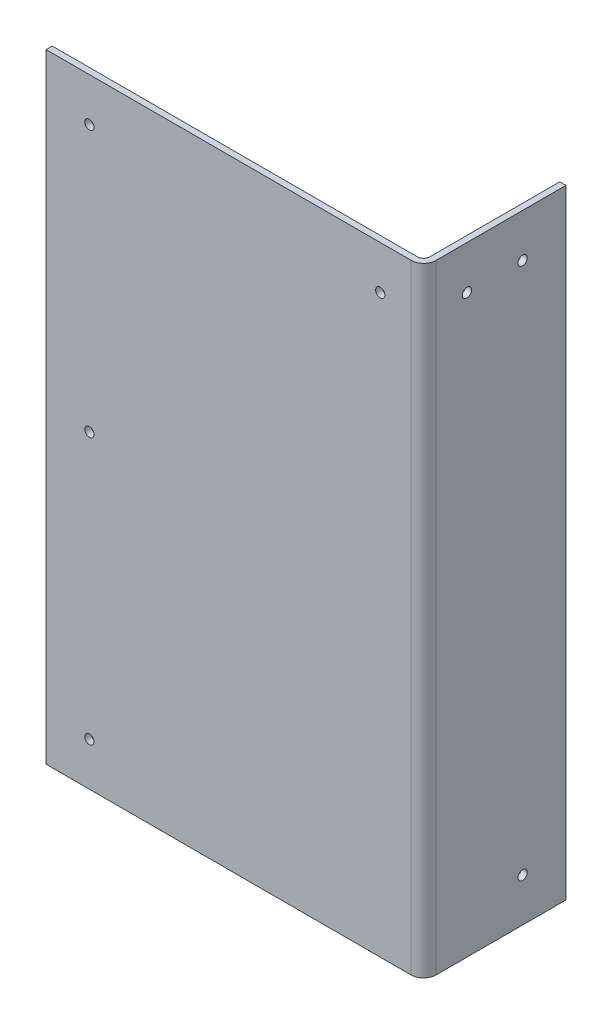
ISO-10303-21;
HEADER;
FILE_DESCRIPTION(('STEP AP214'),'2;1');
FILE_NAME('part.step','',(''),(''),'','','');
FILE_SCHEMA(('AUTOMOTIVE_DESIGN { 1 0 10303 214 1 1 1 1 }'));
ENDSEC;
DATA;
#1=APPLICATION_CONTEXT('core data for automotive mechanical design processes');
#2=APPLICATION_PROTOCOL_DEFINITION('international standard','automotive_design',2000,#1);
#3=PRODUCT_CONTEXT('',#1,'mechanical');
#4=PRODUCT('Part','Part','',(#3));
#5=PRODUCT_RELATED_PRODUCT_CATEGORY('part','',(#4));
#6=PRODUCT_DEFINITION_FORMATION('','',#4);
#7=PRODUCT_DEFINITION_CONTEXT('part definition',#1,'design');
#8=PRODUCT_DEFINITION('design','',#6,#7);
#9=PRODUCT_DEFINITION_SHAPE('','',#8);
#10=(LENGTH_UNIT() NAMED_UNIT(*) SI_UNIT(.MILLI.,.METRE.));
#11=(NAMED_UNIT(*) PLANE_ANGLE_UNIT() SI_UNIT($,.RADIAN.));
#12=(NAMED_UNIT(*) SI_UNIT($,.STERADIAN.) SOLID_ANGLE_UNIT());
#13=UNCERTAINTY_MEASURE_WITH_UNIT(LENGTH_MEASURE(1.E-05),#10,'distance_accuracy_value','');
#14=(GEOMETRIC_REPRESENTATION_CONTEXT(3) GLOBAL_UNCERTAINTY_ASSIGNED_CONTEXT((#13)) GLOBAL_UNIT_ASSIGNED_CONTEXT((#10,
#11,#12)) REPRESENTATION_CONTEXT('',''));
#15=CARTESIAN_POINT('',(0.,0.,0.));
#16=DIRECTION('',(0.,0.,1.));
#17=DIRECTION('',(1.,0.,0.));
#18=AXIS2_PLACEMENT_3D('',#15,#16,#17);
#19=CARTESIAN_POINT('',(387.35,-317.5,-139.7));
#20=DIRECTION('',(-1.,0.,0.));
#21=DIRECTION('',(0.,0.,1.));
#22=AXIS2_PLACEMENT_3D('',#19,#20,#21);
#23=PLANE('',#22);
#24=CARTESIAN_POINT('',(387.35,-273.05,-95.25));
#25=DIRECTION('',(-1.,0.,0.));
#26=DIRECTION('',(0.,0.,1.));
#27=AXIS2_PLACEMENT_3D('',#24,#25,#26);
#28=CIRCLE('',#27,4.7625);
#29=CARTESIAN_POINT('',(387.35,-273.05,-90.4875));
#30=VERTEX_POINT('',#29);
#31=EDGE_CURVE('E136',#30,#30,#28,.T.);
#32=ORIENTED_EDGE('',*,*,#31,.T.);
#33=EDGE_LOOP('',(#32));
#34=FACE_BOUND('',#33,.T.);
#35=CARTESIAN_POINT('',(387.35,273.05,-95.25));
#36=DIRECTION('',(-1.,0.,0.));
#37=DIRECTION('',(0.,0.,1.));
#38=AXIS2_PLACEMENT_3D('',#35,#36,#37);
#39=CIRCLE('',#38,4.7625);
#40=CARTESIAN_POINT('',(387.35,273.05,-90.4875));
#41=VERTEX_POINT('',#40);
#42=EDGE_CURVE('E138',#41,#41,#39,.T.);
#43=ORIENTED_EDGE('',*,*,#42,.T.);
#44=EDGE_LOOP('',(#43));
#45=FACE_BOUND('',#44,.T.);
#46=CARTESIAN_POINT('',(387.35,273.05,-38.1));
#47=DIRECTION('',(-1.,0.,0.));
#48=DIRECTION('',(0.,0.,1.));
#49=AXIS2_PLACEMENT_3D('',#46,#47,#48);
#50=CIRCLE('',#49,4.7625);
#51=CARTESIAN_POINT('',(387.35,273.05,-33.3375));
#52=VERTEX_POINT('',#51);
#53=EDGE_CURVE('E20',#52,#52,#50,.T.);
#54=ORIENTED_EDGE('',*,*,#53,.T.);
#55=EDGE_LOOP('',(#54));
#56=FACE_BOUND('',#55,.T.);
#57=DIRECTION('',(0.,0.,-1.));
#58=VECTOR('',#57,1.);
#59=CARTESIAN_POINT('',(387.35,317.5,-68.2625));
#60=LINE('',#59,#58);
#61=CARTESIAN_POINT('',(387.35,317.5,-139.7));
#62=VERTEX_POINT('',#61);
#63=CARTESIAN_POINT('',(387.35,317.5,-6.35));
#64=VERTEX_POINT('',#63);
#65=EDGE_CURVE('E213',#62,#64,#60,.F.);
#66=ORIENTED_EDGE('',*,*,#65,.T.);
#67=DIRECTION('',(0.,1.,0.));
#68=VECTOR('',#67,1.);
#69=CARTESIAN_POINT('',(387.35,-317.5,-6.35));
#70=LINE('',#69,#68);
#71=CARTESIAN_POINT('',(387.35,-317.5,-6.35));
#72=VERTEX_POINT('',#71);
#73=EDGE_CURVE('E99',#72,#64,#70,.T.);
#74=ORIENTED_EDGE('',*,*,#73,.F.);
#75=DIRECTION('',(0.,0.,-1.));
#76=VECTOR('',#75,1.);
#77=CARTESIAN_POINT('',(387.35,-317.5,-68.2625));
#78=LINE('',#77,#76);
#79=CARTESIAN_POINT('',(387.35,-317.5,-139.7));
#80=VERTEX_POINT('',#79);
#81=EDGE_CURVE('E206',#80,#72,#78,.F.);
#82=ORIENTED_EDGE('',*,*,#81,.F.);
#83=DIRECTION('',(0.,1.,0.));
#84=VECTOR('',#83,1.);
#85=CARTESIAN_POINT('',(387.35,0.,-139.7));
#86=LINE('',#85,#84);
#87=EDGE_CURVE('E143',#80,#62,#86,.T.);
#88=ORIENTED_EDGE('',*,*,#87,.T.);
#89=EDGE_LOOP('',(#66,#74,#82,#88));
#90=FACE_BOUND('',#89,.T.);
#91=ADVANCED_FACE('F17',(#34,#45,#56,#90),#23,.F.);
#92=CARTESIAN_POINT('',(384.175,0.,-139.7));
#93=DIRECTION('',(0.,0.,1.));
#94=DIRECTION('',(1.,0.,0.));
#95=AXIS2_PLACEMENT_3D('',#92,#93,#94);
#96=PLANE('',#95);
#97=ORIENTED_EDGE('',*,*,#87,.F.);
#98=DIRECTION('',(1.,0.,0.));
#99=VECTOR('',#98,1.);
#100=CARTESIAN_POINT('',(384.175,-317.5,-139.7));
#101=LINE('',#100,#99);
#102=CARTESIAN_POINT('',(381.,-317.5,-139.7));
#103=VERTEX_POINT('',#102);
#104=EDGE_CURVE('E209',#103,#80,#101,.T.);
#105=ORIENTED_EDGE('',*,*,#104,.F.);
#106=DIRECTION('',(0.,1.,0.));
#107=VECTOR('',#106,1.);
#108=CARTESIAN_POINT('',(381.,-317.5,-139.7));
#109=LINE('',#108,#107);
#110=CARTESIAN_POINT('',(381.,317.5,-139.7));
#111=VERTEX_POINT('',#110);
#112=EDGE_CURVE('E98',#111,#103,#109,.F.);
#113=ORIENTED_EDGE('',*,*,#112,.F.);
#114=DIRECTION('',(1.,0.,0.));
#115=VECTOR('',#114,1.);
#116=CARTESIAN_POINT('',(384.175,317.5,-139.7));
#117=LINE('',#116,#115);
#118=EDGE_CURVE('E94',#111,#62,#117,.T.);
#119=ORIENTED_EDGE('',*,*,#118,.T.);
#120=EDGE_LOOP('',(#97,#105,#113,#119));
#121=FACE_BOUND('',#120,.T.);
#122=ADVANCED_FACE('F224',(#121),#96,.F.);
#123=CARTESIAN_POINT('',(387.35,273.05,-38.1));
#124=DIRECTION('',(-1.,0.,0.));
#125=DIRECTION('',(0.,0.,1.));
#126=AXIS2_PLACEMENT_3D('',#123,#124,#125);
#127=CYLINDRICAL_SURFACE('',#126,4.7625);
#128=ORIENTED_EDGE('',*,*,#53,.F.);
#129=EDGE_LOOP('',(#128));
#130=FACE_BOUND('',#129,.T.);
#131=CARTESIAN_POINT('',(381.,273.05,-38.1));
#132=DIRECTION('',(-1.,0.,0.));
#133=DIRECTION('',(0.,0.,1.));
#134=AXIS2_PLACEMENT_3D('',#131,#132,#133);
#135=CIRCLE('',#134,4.7625);
#136=CARTESIAN_POINT('',(381.,273.05,-33.3375));
#137=VERTEX_POINT('',#136);
#138=EDGE_CURVE('E133',#137,#137,#135,.F.);
#139=ORIENTED_EDGE('',*,*,#138,.F.);
#140=EDGE_LOOP('',(#139));
#141=FACE_BOUND('',#140,.T.);
#142=ADVANCED_FACE('F371',(#130,#141),#127,.F.);
#143=CARTESIAN_POINT('',(387.35,273.05,-95.25));
#144=DIRECTION('',(-1.,0.,0.));
#145=DIRECTION('',(0.,0.,1.));
#146=AXIS2_PLACEMENT_3D('',#143,#144,#145);
#147=CYLINDRICAL_SURFACE('',#146,4.7625);
#148=ORIENTED_EDGE('',*,*,#42,.F.);
#149=EDGE_LOOP('',(#148));
#150=FACE_BOUND('',#149,.T.);
#151=CARTESIAN_POINT('',(381.,273.05,-95.25));
#152=DIRECTION('',(-1.,0.,0.));
#153=DIRECTION('',(0.,0.,1.));
#154=AXIS2_PLACEMENT_3D('',#151,#152,#153);
#155=CIRCLE('',#154,4.7625);
#156=CARTESIAN_POINT('',(381.,273.05,-90.4875));
#157=VERTEX_POINT('',#156);
#158=EDGE_CURVE('E130',#157,#157,#155,.F.);
#159=ORIENTED_EDGE('',*,*,#158,.F.);
#160=EDGE_LOOP('',(#159));
#161=FACE_BOUND('',#160,.T.);
#162=ADVANCED_FACE('F362',(#150,#161),#147,.F.);
#163=CARTESIAN_POINT('',(387.35,-273.05,-95.25));
#164=DIRECTION('',(-1.,0.,0.));
#165=DIRECTION('',(0.,0.,1.));
#166=AXIS2_PLACEMENT_3D('',#163,#164,#165);
#167=CYLINDRICAL_SURFACE('',#166,4.7625);
#168=ORIENTED_EDGE('',*,*,#31,.F.);
#169=EDGE_LOOP('',(#168));
#170=FACE_BOUND('',#169,.T.);
#171=CARTESIAN_POINT('',(381.,-273.05,-95.25));
#172=DIRECTION('',(-1.,0.,0.));
#173=DIRECTION('',(0.,0.,1.));
#174=AXIS2_PLACEMENT_3D('',#171,#172,#173);
#175=CIRCLE('',#174,4.7625);
#176=CARTESIAN_POINT('',(381.,-273.05,-90.4875));
#177=VERTEX_POINT('',#176);
#178=EDGE_CURVE('E127',#177,#177,#175,.F.);
#179=ORIENTED_EDGE('',*,*,#178,.F.);
#180=EDGE_LOOP('',(#179));
#181=FACE_BOUND('',#180,.T.);
#182=ADVANCED_FACE('F354',(#170,#181),#167,.F.);
#183=CARTESIAN_POINT('',(374.65,-317.5,-6.35));
#184=DIRECTION('',(0.,1.,0.));
#185=DIRECTION('',(0.,0.,1.));
#186=AXIS2_PLACEMENT_3D('',#183,#184,#185);
#187=CYLINDRICAL_SURFACE('',#186,12.7);
#188=CARTESIAN_POINT('',(374.65,317.5,-6.35));
#189=DIRECTION('',(0.,1.,0.));
#190=DIRECTION('',(0.,0.,1.));
#191=AXIS2_PLACEMENT_3D('',#188,#189,#190);
#192=CIRCLE('',#191,12.7);
#193=CARTESIAN_POINT('',(374.65,317.5,6.35));
#194=VERTEX_POINT('',#193);
#195=EDGE_CURVE('E57',#194,#64,#192,.T.);
#196=ORIENTED_EDGE('',*,*,#195,.F.);
#197=DIRECTION('',(0.,1.,0.));
#198=VECTOR('',#197,1.);
#199=CARTESIAN_POINT('',(374.65,-317.5,6.35));
#200=LINE('',#199,#198);
#201=CARTESIAN_POINT('',(374.65,-317.5,6.35));
#202=VERTEX_POINT('',#201);
#203=EDGE_CURVE('E125',#194,#202,#200,.F.);
#204=ORIENTED_EDGE('',*,*,#203,.T.);
#205=CARTESIAN_POINT('',(374.65,-317.5,-6.35));
#206=DIRECTION('',(0.,1.,0.));
#207=DIRECTION('',(0.,0.,1.));
#208=AXIS2_PLACEMENT_3D('',#205,#206,#207);
#209=CIRCLE('',#208,12.7);
#210=EDGE_CURVE('E122',#202,#72,#209,.T.);
#211=ORIENTED_EDGE('',*,*,#210,.T.);
#212=ORIENTED_EDGE('',*,*,#73,.T.);
#213=EDGE_LOOP('',(#196,#204,#211,#212));
#214=FACE_BOUND('',#213,.T.);
#215=ADVANCED_FACE('F225',(#214),#187,.T.);
#216=CARTESIAN_POINT('',(381.,-317.5,-139.7));
#217=DIRECTION('',(-1.,0.,0.));
#218=DIRECTION('',(0.,0.,1.));
#219=AXIS2_PLACEMENT_3D('',#216,#217,#218);
#220=PLANE('',#219);
#221=ORIENTED_EDGE('',*,*,#178,.T.);
#222=EDGE_LOOP('',(#221));
#223=FACE_BOUND('',#222,.T.);
#224=ORIENTED_EDGE('',*,*,#158,.T.);
#225=EDGE_LOOP('',(#224));
#226=FACE_BOUND('',#225,.T.);
#227=ORIENTED_EDGE('',*,*,#138,.T.);
#228=EDGE_LOOP('',(#227));
#229=FACE_BOUND('',#228,.T.);
#230=ORIENTED_EDGE('',*,*,#112,.T.);
#231=DIRECTION('',(0.,0.,1.));
#232=VECTOR('',#231,1.);
#233=CARTESIAN_POINT('',(381.,-317.5,-139.7));
#234=LINE('',#233,#232);
#235=CARTESIAN_POINT('',(381.,-317.5,-6.35));
#236=VERTEX_POINT('',#235);
#237=EDGE_CURVE('E105',#103,#236,#234,.T.);
#238=ORIENTED_EDGE('',*,*,#237,.T.);
#239=DIRECTION('',(0.,1.,0.));
#240=VECTOR('',#239,1.);
#241=CARTESIAN_POINT('',(381.,-317.5,-6.35));
#242=LINE('',#241,#240);
#243=CARTESIAN_POINT('',(381.,317.5,-6.35));
#244=VERTEX_POINT('',#243);
#245=EDGE_CURVE('E102',#236,#244,#242,.T.);
#246=ORIENTED_EDGE('',*,*,#245,.T.);
#247=DIRECTION('',(0.,0.,1.));
#248=VECTOR('',#247,1.);
#249=CARTESIAN_POINT('',(381.,317.5,-139.7));
#250=LINE('',#249,#248);
#251=EDGE_CURVE('E85',#244,#111,#250,.F.);
#252=ORIENTED_EDGE('',*,*,#251,.T.);
#253=EDGE_LOOP('',(#230,#238,#246,#252));
#254=FACE_BOUND('',#253,.T.);
#255=ADVANCED_FACE('F103',(#223,#226,#229,#254),#220,.T.);
#256=CARTESIAN_POINT('',(381.,-317.5,6.35));
#257=DIRECTION('',(0.,0.,-1.));
#258=DIRECTION('',(-1.,0.,0.));
#259=AXIS2_PLACEMENT_3D('',#256,#257,#258);
#260=PLANE('',#259);
#261=CARTESIAN_POINT('',(342.9,273.05,6.35));
#262=DIRECTION('',(0.,0.,-1.));
#263=DIRECTION('',(-1.,0.,0.));
#264=AXIS2_PLACEMENT_3D('',#261,#262,#263);
#265=CIRCLE('',#264,4.7625);
#266=CARTESIAN_POINT('',(338.1375,273.05,6.35));
#267=VERTEX_POINT('',#266);
#268=EDGE_CURVE('E165',#267,#267,#265,.T.);
#269=ORIENTED_EDGE('',*,*,#268,.T.);
#270=EDGE_LOOP('',(#269));
#271=FACE_BOUND('',#270,.T.);
#272=CARTESIAN_POINT('',(44.45,-273.05,6.35));
#273=DIRECTION('',(0.,0.,-1.));
#274=DIRECTION('',(-1.,0.,0.));
#275=AXIS2_PLACEMENT_3D('',#272,#273,#274);
#276=CIRCLE('',#275,4.7625);
#277=CARTESIAN_POINT('',(39.6875,-273.05,6.35));
#278=VERTEX_POINT('',#277);
#279=EDGE_CURVE('E169',#278,#278,#276,.T.);
#280=ORIENTED_EDGE('',*,*,#279,.T.);
#281=EDGE_LOOP('',(#280));
#282=FACE_BOUND('',#281,.T.);
#283=CARTESIAN_POINT('',(44.45,0.,6.35));
#284=DIRECTION('',(0.,0.,-1.));
#285=DIRECTION('',(-1.,0.,0.));
#286=AXIS2_PLACEMENT_3D('',#283,#284,#285);
#287=CIRCLE('',#286,4.7625);
#288=CARTESIAN_POINT('',(39.6875,0.,6.35));
#289=VERTEX_POINT('',#288);
#290=EDGE_CURVE('E171',#289,#289,#287,.T.);
#291=ORIENTED_EDGE('',*,*,#290,.T.);
#292=EDGE_LOOP('',(#291));
#293=FACE_BOUND('',#292,.T.);
#294=CARTESIAN_POINT('',(44.45,273.05,6.35));
#295=DIRECTION('',(0.,0.,-1.));
#296=DIRECTION('',(-1.,0.,0.));
#297=AXIS2_PLACEMENT_3D('',#294,#295,#296);
#298=CIRCLE('',#297,4.7625);
#299=CARTESIAN_POINT('',(39.6875,273.05,6.35));
#300=VERTEX_POINT('',#299);
#301=EDGE_CURVE('E118',#300,#300,#298,.T.);
#302=ORIENTED_EDGE('',*,*,#301,.T.);
#303=EDGE_LOOP('',(#302));
#304=FACE_BOUND('',#303,.T.);
#305=DIRECTION('',(1.,0.,0.));
#306=VECTOR('',#305,1.);
#307=CARTESIAN_POINT('',(192.0875,317.5,6.35));
#308=LINE('',#307,#306);
#309=CARTESIAN_POINT('',(0.,317.5,6.35));
#310=VERTEX_POINT('',#309);
#311=EDGE_CURVE('E64',#194,#310,#308,.F.);
#312=ORIENTED_EDGE('',*,*,#311,.T.);
#313=DIRECTION('',(0.,1.,0.));
#314=VECTOR('',#313,1.);
#315=CARTESIAN_POINT('',(0.,0.,6.35));
#316=LINE('',#315,#314);
#317=CARTESIAN_POINT('',(0.,-317.5,6.35));
#318=VERTEX_POINT('',#317);
#319=EDGE_CURVE('E188',#318,#310,#316,.T.);
#320=ORIENTED_EDGE('',*,*,#319,.F.);
#321=DIRECTION('',(1.,0.,0.));
#322=VECTOR('',#321,1.);
#323=CARTESIAN_POINT('',(192.0875,-317.5,6.35));
#324=LINE('',#323,#322);
#325=EDGE_CURVE('E111',#202,#318,#324,.F.);
#326=ORIENTED_EDGE('',*,*,#325,.F.);
#327=ORIENTED_EDGE('',*,*,#203,.F.);
#328=EDGE_LOOP('',(#312,#320,#326,#327));
#329=FACE_BOUND('',#328,.T.);
#330=ADVANCED_FACE('F239',(#271,#282,#293,#304,#329),#260,.F.);
#331=CARTESIAN_POINT('',(0.,0.,3.175));
#332=DIRECTION('',(-1.,0.,0.));
#333=DIRECTION('',(0.,0.,1.));
#334=AXIS2_PLACEMENT_3D('',#331,#332,#333);
#335=PLANE('',#334);
#336=DIRECTION('',(0.,0.,-1.));
#337=VECTOR('',#336,1.);
#338=CARTESIAN_POINT('',(0.,317.5,3.175));
#339=LINE('',#338,#337);
#340=CARTESIAN_POINT('',(0.,317.5,0.));
#341=VERTEX_POINT('',#340);
#342=EDGE_CURVE('E121',#310,#341,#339,.T.);
#343=ORIENTED_EDGE('',*,*,#342,.T.);
#344=DIRECTION('',(0.,1.,0.));
#345=VECTOR('',#344,1.);
#346=CARTESIAN_POINT('',(0.,-317.5,0.));
#347=LINE('',#346,#345);
#348=CARTESIAN_POINT('',(0.,-317.5,0.));
#349=VERTEX_POINT('',#348);
#350=EDGE_CURVE('E168',#349,#341,#347,.T.);
#351=ORIENTED_EDGE('',*,*,#350,.F.);
#352=DIRECTION('',(0.,0.,-1.));
#353=VECTOR('',#352,1.);
#354=CARTESIAN_POINT('',(0.,-317.5,3.175));
#355=LINE('',#354,#353);
#356=EDGE_CURVE('E114',#318,#349,#355,.T.);
#357=ORIENTED_EDGE('',*,*,#356,.F.);
#358=ORIENTED_EDGE('',*,*,#319,.T.);
#359=EDGE_LOOP('',(#343,#351,#357,#358));
#360=FACE_BOUND('',#359,.T.);
#361=ADVANCED_FACE('F238',(#360),#335,.T.);
#362=CARTESIAN_POINT('',(192.0875,317.5,3.175));
#363=DIRECTION('',(0.,-1.,0.));
#364=DIRECTION('',(0.,0.,-1.));
#365=AXIS2_PLACEMENT_3D('',#362,#363,#364);
#366=PLANE('',#365);
#367=ORIENTED_EDGE('',*,*,#342,.F.);
#368=ORIENTED_EDGE('',*,*,#311,.F.);
#369=ORIENTED_EDGE('',*,*,#195,.T.);
#370=ORIENTED_EDGE('',*,*,#65,.F.);
#371=ORIENTED_EDGE('',*,*,#118,.F.);
#372=ORIENTED_EDGE('',*,*,#251,.F.);
#373=CARTESIAN_POINT('',(374.65,317.5,-6.35));
#374=DIRECTION('',(0.,1.,0.));
#375=DIRECTION('',(0.,0.,1.));
#376=AXIS2_PLACEMENT_3D('',#373,#374,#375);
#377=CIRCLE('',#376,6.35);
#378=CARTESIAN_POINT('',(374.65,317.5,0.));
#379=VERTEX_POINT('',#378);
#380=EDGE_CURVE('E91',#244,#379,#377,.F.);
#381=ORIENTED_EDGE('',*,*,#380,.T.);
#382=DIRECTION('',(-1.,0.,0.));
#383=VECTOR('',#382,1.);
#384=CARTESIAN_POINT('',(381.,317.5,0.));
#385=LINE('',#384,#383);
#386=EDGE_CURVE('E192',#341,#379,#385,.F.);
#387=ORIENTED_EDGE('',*,*,#386,.F.);
#388=EDGE_LOOP('',(#367,#368,#369,#370,#371,#372,#381,#387));
#389=FACE_BOUND('',#388,.T.);
#390=ADVANCED_FACE('F88',(#389),#366,.F.);
#391=CARTESIAN_POINT('',(374.65,-317.5,-6.35));
#392=DIRECTION('',(0.,1.,0.));
#393=DIRECTION('',(0.,0.,1.));
#394=AXIS2_PLACEMENT_3D('',#391,#392,#393);
#395=CYLINDRICAL_SURFACE('',#394,6.35);
#396=ORIENTED_EDGE('',*,*,#245,.F.);
#397=CARTESIAN_POINT('',(374.65,-317.5,-6.35));
#398=DIRECTION('',(0.,1.,0.));
#399=DIRECTION('',(0.,0.,1.));
#400=AXIS2_PLACEMENT_3D('',#397,#398,#399);
#401=CIRCLE('',#400,6.35);
#402=CARTESIAN_POINT('',(374.65,-317.5,0.));
#403=VERTEX_POINT('',#402);
#404=EDGE_CURVE('E35',#403,#236,#401,.T.);
#405=ORIENTED_EDGE('',*,*,#404,.F.);
#406=DIRECTION('',(0.,1.,0.));
#407=VECTOR('',#406,1.);
#408=CARTESIAN_POINT('',(374.65,-317.5,0.));
#409=LINE('',#408,#407);
#410=EDGE_CURVE('E109',#379,#403,#409,.F.);
#411=ORIENTED_EDGE('',*,*,#410,.F.);
#412=ORIENTED_EDGE('',*,*,#380,.F.);
#413=EDGE_LOOP('',(#396,#405,#411,#412));
#414=FACE_BOUND('',#413,.T.);
#415=ADVANCED_FACE('F107',(#414),#395,.F.);
#416=CARTESIAN_POINT('',(192.0875,-317.5,3.175));
#417=DIRECTION('',(0.,-1.,0.));
#418=DIRECTION('',(0.,0.,-1.));
#419=AXIS2_PLACEMENT_3D('',#416,#417,#418);
#420=PLANE('',#419);
#421=DIRECTION('',(-1.,0.,0.));
#422=VECTOR('',#421,1.);
#423=CARTESIAN_POINT('',(381.,-317.5,0.));
#424=LINE('',#423,#422);
#425=EDGE_CURVE('E164',#403,#349,#424,.T.);
#426=ORIENTED_EDGE('',*,*,#425,.F.);
#427=ORIENTED_EDGE('',*,*,#404,.T.);
#428=ORIENTED_EDGE('',*,*,#237,.F.);
#429=ORIENTED_EDGE('',*,*,#104,.T.);
#430=ORIENTED_EDGE('',*,*,#81,.T.);
#431=ORIENTED_EDGE('',*,*,#210,.F.);
#432=ORIENTED_EDGE('',*,*,#325,.T.);
#433=ORIENTED_EDGE('',*,*,#356,.T.);
#434=EDGE_LOOP('',(#426,#427,#428,#429,#430,#431,#432,#433));
#435=FACE_BOUND('',#434,.T.);
#436=ADVANCED_FACE('F228',(#435),#420,.T.);
#437=CARTESIAN_POINT('',(44.45,273.05,6.35));
#438=DIRECTION('',(0.,0.,-1.));
#439=DIRECTION('',(-1.,0.,0.));
#440=AXIS2_PLACEMENT_3D('',#437,#438,#439);
#441=CYLINDRICAL_SURFACE('',#440,4.7625);
#442=ORIENTED_EDGE('',*,*,#301,.F.);
#443=EDGE_LOOP('',(#442));
#444=FACE_BOUND('',#443,.T.);
#445=CARTESIAN_POINT('',(44.45,273.05,0.));
#446=DIRECTION('',(0.,0.,-1.));
#447=DIRECTION('',(-1.,0.,0.));
#448=AXIS2_PLACEMENT_3D('',#445,#446,#447);
#449=CIRCLE('',#448,4.7625);
#450=CARTESIAN_POINT('',(39.6875,273.05,0.));
#451=VERTEX_POINT('',#450);
#452=EDGE_CURVE('E161',#451,#451,#449,.F.);
#453=ORIENTED_EDGE('',*,*,#452,.F.);
#454=EDGE_LOOP('',(#453));
#455=FACE_BOUND('',#454,.T.);
#456=ADVANCED_FACE('F270',(#444,#455),#441,.F.);
#457=CARTESIAN_POINT('',(44.45,0.,6.35));
#458=DIRECTION('',(0.,0.,-1.));
#459=DIRECTION('',(-1.,0.,0.));
#460=AXIS2_PLACEMENT_3D('',#457,#458,#459);
#461=CYLINDRICAL_SURFACE('',#460,4.7625);
#462=ORIENTED_EDGE('',*,*,#290,.F.);
#463=EDGE_LOOP('',(#462));
#464=FACE_BOUND('',#463,.T.);
#465=CARTESIAN_POINT('',(44.45,0.,0.));
#466=DIRECTION('',(0.,0.,-1.));
#467=DIRECTION('',(-1.,0.,0.));
#468=AXIS2_PLACEMENT_3D('',#465,#466,#467);
#469=CIRCLE('',#468,4.7625);
#470=CARTESIAN_POINT('',(39.6875,0.,0.));
#471=VERTEX_POINT('',#470);
#472=EDGE_CURVE('E158',#471,#471,#469,.F.);
#473=ORIENTED_EDGE('',*,*,#472,.F.);
#474=EDGE_LOOP('',(#473));
#475=FACE_BOUND('',#474,.T.);
#476=ADVANCED_FACE('F266',(#464,#475),#461,.F.);
#477=CARTESIAN_POINT('',(44.45,-273.05,6.35));
#478=DIRECTION('',(0.,0.,-1.));
#479=DIRECTION('',(-1.,0.,0.));
#480=AXIS2_PLACEMENT_3D('',#477,#478,#479);
#481=CYLINDRICAL_SURFACE('',#480,4.7625);
#482=ORIENTED_EDGE('',*,*,#279,.F.);
#483=EDGE_LOOP('',(#482));
#484=FACE_BOUND('',#483,.T.);
#485=CARTESIAN_POINT('',(44.45,-273.05,0.));
#486=DIRECTION('',(0.,0.,-1.));
#487=DIRECTION('',(-1.,0.,0.));
#488=AXIS2_PLACEMENT_3D('',#485,#486,#487);
#489=CIRCLE('',#488,4.7625);
#490=CARTESIAN_POINT('',(39.6875,-273.05,0.));
#491=VERTEX_POINT('',#490);
#492=EDGE_CURVE('E26',#491,#491,#489,.F.);
#493=ORIENTED_EDGE('',*,*,#492,.F.);
#494=EDGE_LOOP('',(#493));
#495=FACE_BOUND('',#494,.T.);
#496=ADVANCED_FACE('F259',(#484,#495),#481,.F.);
#497=CARTESIAN_POINT('',(342.9,273.05,6.35));
#498=DIRECTION('',(0.,0.,-1.));
#499=DIRECTION('',(-1.,0.,0.));
#500=AXIS2_PLACEMENT_3D('',#497,#498,#499);
#501=CYLINDRICAL_SURFACE('',#500,4.7625);
#502=ORIENTED_EDGE('',*,*,#268,.F.);
#503=EDGE_LOOP('',(#502));
#504=FACE_BOUND('',#503,.T.);
#505=CARTESIAN_POINT('',(342.9,273.05,0.));
#506=DIRECTION('',(0.,0.,-1.));
#507=DIRECTION('',(-1.,0.,0.));
#508=AXIS2_PLACEMENT_3D('',#505,#506,#507);
#509=CIRCLE('',#508,4.7625);
#510=CARTESIAN_POINT('',(338.1375,273.05,0.));
#511=VERTEX_POINT('',#510);
#512=EDGE_CURVE('E11',#511,#511,#509,.F.);
#513=ORIENTED_EDGE('',*,*,#512,.F.);
#514=EDGE_LOOP('',(#513));
#515=FACE_BOUND('',#514,.T.);
#516=ADVANCED_FACE('F253',(#504,#515),#501,.F.);
#517=CARTESIAN_POINT('',(381.,-317.5,0.));
#518=DIRECTION('',(0.,0.,-1.));
#519=DIRECTION('',(-1.,0.,0.));
#520=AXIS2_PLACEMENT_3D('',#517,#518,#519);
#521=PLANE('',#520);
#522=ORIENTED_EDGE('',*,*,#512,.T.);
#523=EDGE_LOOP('',(#522));
#524=FACE_BOUND('',#523,.T.);
#525=ORIENTED_EDGE('',*,*,#492,.T.);
#526=EDGE_LOOP('',(#525));
#527=FACE_BOUND('',#526,.T.);
#528=ORIENTED_EDGE('',*,*,#472,.T.);
#529=EDGE_LOOP('',(#528));
#530=FACE_BOUND('',#529,.T.);
#531=ORIENTED_EDGE('',*,*,#452,.T.);
#532=EDGE_LOOP('',(#531));
#533=FACE_BOUND('',#532,.T.);
#534=ORIENTED_EDGE('',*,*,#410,.T.);
#535=ORIENTED_EDGE('',*,*,#425,.T.);
#536=ORIENTED_EDGE('',*,*,#350,.T.);
#537=ORIENTED_EDGE('',*,*,#386,.T.);
#538=EDGE_LOOP('',(#534,#535,#536,#537));
#539=FACE_BOUND('',#538,.T.);
#540=ADVANCED_FACE('F232',(#524,#527,#530,#533,#539),#521,.T.);
#541=CLOSED_SHELL('',(#91,#122,#142,#162,#182,#215,#255,#330,#361,#390,#415,#436,#456,#476,#496,
#516,#540));
#542=MANIFOLD_SOLID_BREP('B1',#541);
#543=ADVANCED_BREP_SHAPE_REPRESENTATION('',(#18,#542),#14);
#544=SHAPE_DEFINITION_REPRESENTATION(#9,#543);
ENDSEC;
END-ISO-10303-21;
